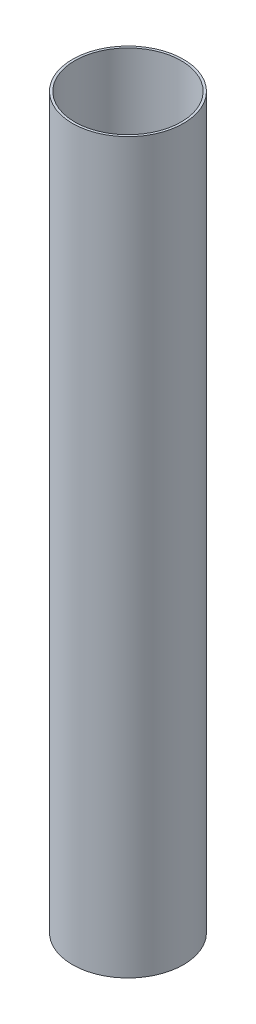
ISO-10303-21;
HEADER;
FILE_DESCRIPTION(('STEP AP214'),'2;1');
FILE_NAME('part.step','',(''),(''),'','','');
FILE_SCHEMA(('AUTOMOTIVE_DESIGN { 1 0 10303 214 1 1 1 1 }'));
ENDSEC;
DATA;
#1=APPLICATION_CONTEXT('core data for automotive mechanical design processes');
#2=APPLICATION_PROTOCOL_DEFINITION('international standard','automotive_design',2000,#1);
#3=PRODUCT_CONTEXT('',#1,'mechanical');
#4=PRODUCT('Part','Part','',(#3));
#5=PRODUCT_RELATED_PRODUCT_CATEGORY('part','',(#4));
#6=PRODUCT_DEFINITION_FORMATION('','',#4);
#7=PRODUCT_DEFINITION_CONTEXT('part definition',#1,'design');
#8=PRODUCT_DEFINITION('design','',#6,#7);
#9=PRODUCT_DEFINITION_SHAPE('','',#8);
#10=(LENGTH_UNIT() NAMED_UNIT(*) SI_UNIT(.MILLI.,.METRE.));
#11=(NAMED_UNIT(*) PLANE_ANGLE_UNIT() SI_UNIT($,.RADIAN.));
#12=(NAMED_UNIT(*) SI_UNIT($,.STERADIAN.) SOLID_ANGLE_UNIT());
#13=UNCERTAINTY_MEASURE_WITH_UNIT(LENGTH_MEASURE(1.E-05),#10,'distance_accuracy_value','');
#14=(GEOMETRIC_REPRESENTATION_CONTEXT(3) GLOBAL_UNCERTAINTY_ASSIGNED_CONTEXT((#13)) GLOBAL_UNIT_ASSIGNED_CONTEXT((#10,
#11,#12)) REPRESENTATION_CONTEXT('',''));
#15=CARTESIAN_POINT('',(0.,0.,0.));
#16=DIRECTION('',(0.,0.,1.));
#17=DIRECTION('',(1.,0.,0.));
#18=AXIS2_PLACEMENT_3D('',#15,#16,#17);
#19=CARTESIAN_POINT('',(0.,500.,0.));
#20=DIRECTION('',(0.,1.,0.));
#21=DIRECTION('',(0.,0.,1.));
#22=AXIS2_PLACEMENT_3D('',#19,#20,#21);
#23=PLANE('',#22);
#24=CARTESIAN_POINT('',(0.,500.,0.));
#25=DIRECTION('',(0.,1.,0.));
#26=DIRECTION('',(0.,0.,1.));
#27=AXIS2_PLACEMENT_3D('',#24,#25,#26);
#28=CIRCLE('',#27,38.1);
#29=CARTESIAN_POINT('',(0.,500.,38.1));
#30=VERTEX_POINT('',#29);
#31=EDGE_CURVE('E10',#30,#30,#28,.T.);
#32=ORIENTED_EDGE('',*,*,#31,.T.);
#33=EDGE_LOOP('',(#32));
#34=FACE_BOUND('',#33,.T.);
#35=CARTESIAN_POINT('',(0.,500.,0.));
#36=DIRECTION('',(0.,1.,0.));
#37=DIRECTION('',(0.,0.,1.));
#38=AXIS2_PLACEMENT_3D('',#35,#36,#37);
#39=CIRCLE('',#38,36.5);
#40=CARTESIAN_POINT('',(0.,500.,36.5));
#41=VERTEX_POINT('',#40);
#42=EDGE_CURVE('E56',#41,#41,#39,.T.);
#43=ORIENTED_EDGE('',*,*,#42,.F.);
#44=EDGE_LOOP('',(#43));
#45=FACE_BOUND('',#44,.T.);
#46=ADVANCED_FACE('F43',(#34,#45),#23,.T.);
#47=CARTESIAN_POINT('',(0.,0.,0.));
#48=DIRECTION('',(0.,1.,0.));
#49=DIRECTION('',(0.,0.,1.));
#50=AXIS2_PLACEMENT_3D('',#47,#48,#49);
#51=PLANE('',#50);
#52=CARTESIAN_POINT('',(0.,0.,0.));
#53=DIRECTION('',(0.,1.,0.));
#54=DIRECTION('',(0.,0.,1.));
#55=AXIS2_PLACEMENT_3D('',#52,#53,#54);
#56=CIRCLE('',#55,38.1);
#57=CARTESIAN_POINT('',(0.,0.,38.1));
#58=VERTEX_POINT('',#57);
#59=EDGE_CURVE('E47',#58,#58,#56,.T.);
#60=ORIENTED_EDGE('',*,*,#59,.F.);
#61=EDGE_LOOP('',(#60));
#62=FACE_BOUND('',#61,.T.);
#63=CARTESIAN_POINT('',(0.,0.,0.));
#64=DIRECTION('',(0.,1.,0.));
#65=DIRECTION('',(0.,0.,1.));
#66=AXIS2_PLACEMENT_3D('',#63,#64,#65);
#67=CIRCLE('',#66,36.5);
#68=CARTESIAN_POINT('',(0.,0.,36.5));
#69=VERTEX_POINT('',#68);
#70=EDGE_CURVE('E58',#69,#69,#67,.T.);
#71=ORIENTED_EDGE('',*,*,#70,.T.);
#72=EDGE_LOOP('',(#71));
#73=FACE_BOUND('',#72,.T.);
#74=ADVANCED_FACE('F70',(#62,#73),#51,.F.);
#75=CARTESIAN_POINT('',(0.,500.,0.));
#76=DIRECTION('',(0.,-1.,0.));
#77=DIRECTION('',(0.,0.,-1.));
#78=AXIS2_PLACEMENT_3D('',#75,#76,#77);
#79=CYLINDRICAL_SURFACE('',#78,38.1);
#80=ORIENTED_EDGE('',*,*,#31,.F.);
#81=EDGE_LOOP('',(#80));
#82=FACE_BOUND('',#81,.T.);
#83=ORIENTED_EDGE('',*,*,#59,.T.);
#84=EDGE_LOOP('',(#83));
#85=FACE_BOUND('',#84,.T.);
#86=ADVANCED_FACE('F45',(#82,#85),#79,.T.);
#87=CARTESIAN_POINT('',(0.,500.,0.));
#88=DIRECTION('',(0.,-1.,0.));
#89=DIRECTION('',(0.,0.,-1.));
#90=AXIS2_PLACEMENT_3D('',#87,#88,#89);
#91=CYLINDRICAL_SURFACE('',#90,36.5);
#92=ORIENTED_EDGE('',*,*,#42,.T.);
#93=EDGE_LOOP('',(#92));
#94=FACE_BOUND('',#93,.T.);
#95=ORIENTED_EDGE('',*,*,#70,.F.);
#96=EDGE_LOOP('',(#95));
#97=FACE_BOUND('',#96,.T.);
#98=ADVANCED_FACE('F66',(#94,#97),#91,.F.);
#99=CLOSED_SHELL('',(#46,#74,#86,#98));
#100=MANIFOLD_SOLID_BREP('B2',#99);
#101=ADVANCED_BREP_SHAPE_REPRESENTATION('',(#18,#100),#14);
#102=SHAPE_DEFINITION_REPRESENTATION(#9,#101);
ENDSEC;
END-ISO-10303-21;
